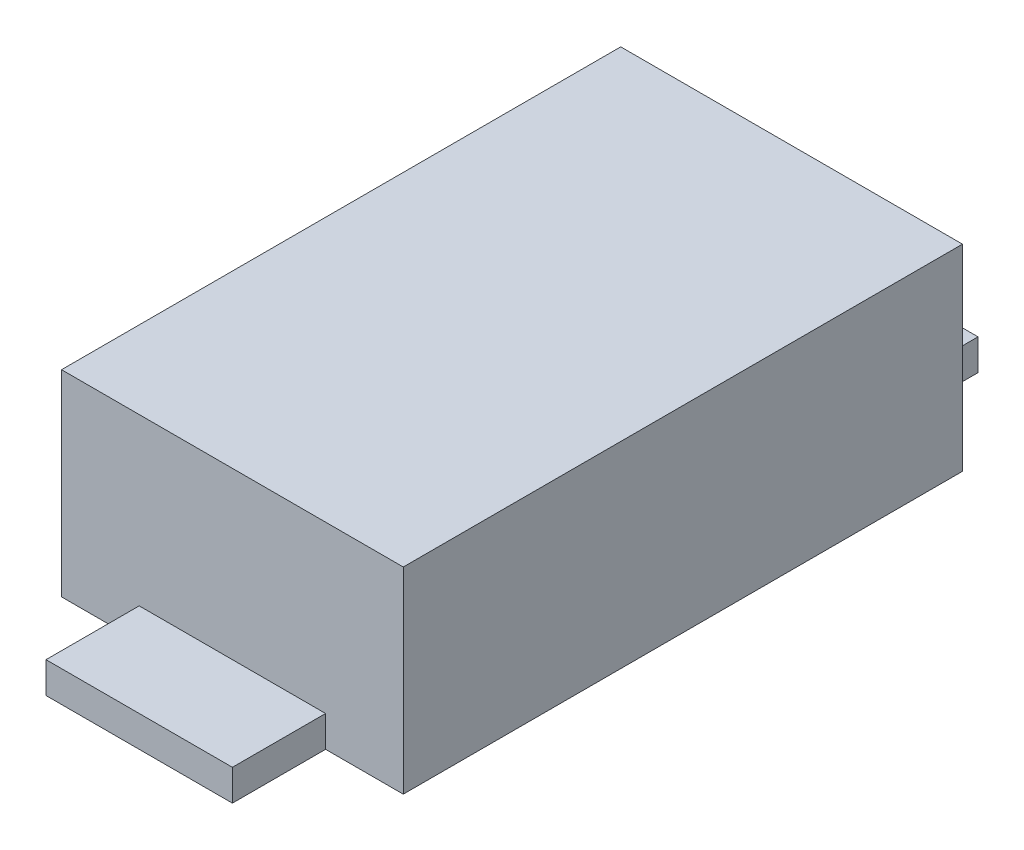
ISO-10303-21;
HEADER;
FILE_DESCRIPTION(('STEP AP214'),'2;1');
FILE_NAME('part.step','',(''),(''),'','','');
FILE_SCHEMA(('AUTOMOTIVE_DESIGN { 1 0 10303 214 1 1 1 1 }'));
ENDSEC;
DATA;
#1=APPLICATION_CONTEXT('core data for automotive mechanical design processes');
#2=APPLICATION_PROTOCOL_DEFINITION('international standard','automotive_design',2000,#1);
#3=PRODUCT_CONTEXT('',#1,'mechanical');
#4=PRODUCT('Part','Part','',(#3));
#5=PRODUCT_RELATED_PRODUCT_CATEGORY('part','',(#4));
#6=PRODUCT_DEFINITION_FORMATION('','',#4);
#7=PRODUCT_DEFINITION_CONTEXT('part definition',#1,'design');
#8=PRODUCT_DEFINITION('design','',#6,#7);
#9=PRODUCT_DEFINITION_SHAPE('','',#8);
#10=(LENGTH_UNIT() NAMED_UNIT(*) SI_UNIT(.MILLI.,.METRE.));
#11=(NAMED_UNIT(*) PLANE_ANGLE_UNIT() SI_UNIT($,.RADIAN.));
#12=(NAMED_UNIT(*) SI_UNIT($,.STERADIAN.) SOLID_ANGLE_UNIT());
#13=UNCERTAINTY_MEASURE_WITH_UNIT(LENGTH_MEASURE(1.E-05),#10,'distance_accuracy_value','');
#14=(GEOMETRIC_REPRESENTATION_CONTEXT(3) GLOBAL_UNCERTAINTY_ASSIGNED_CONTEXT((#13)) GLOBAL_UNIT_ASSIGNED_CONTEXT((#10,
#11,#12)) REPRESENTATION_CONTEXT('',''));
#15=CARTESIAN_POINT('',(0.,0.,0.));
#16=DIRECTION('',(0.,0.,1.));
#17=DIRECTION('',(1.,0.,0.));
#18=AXIS2_PLACEMENT_3D('',#15,#16,#17);
#19=CARTESIAN_POINT('',(-0.825,0.95,1.35));
#20=DIRECTION('',(0.,0.,-1.));
#21=DIRECTION('',(-1.,0.,0.));
#22=AXIS2_PLACEMENT_3D('',#19,#20,#21);
#23=PLANE('',#22);
#24=DIRECTION('',(0.,-1.,0.));
#25=VECTOR('',#24,1.);
#26=CARTESIAN_POINT('',(-0.45,0.15,1.35));
#27=LINE('',#26,#25);
#28=CARTESIAN_POINT('',(-0.45,0.15,1.35));
#29=VERTEX_POINT('',#28);
#30=CARTESIAN_POINT('',(-0.45,0.,1.35));
#31=VERTEX_POINT('',#30);
#32=EDGE_CURVE('E154',#29,#31,#27,.T.);
#33=ORIENTED_EDGE('',*,*,#32,.F.);
#34=DIRECTION('',(1.,0.,0.));
#35=VECTOR('',#34,1.);
#36=CARTESIAN_POINT('',(-0.45,0.15,1.35));
#37=LINE('',#36,#35);
#38=CARTESIAN_POINT('',(0.45,0.15,1.35));
#39=VERTEX_POINT('',#38);
#40=EDGE_CURVE('E145',#29,#39,#37,.T.);
#41=ORIENTED_EDGE('',*,*,#40,.T.);
#42=DIRECTION('',(0.,-1.,0.));
#43=VECTOR('',#42,1.);
#44=CARTESIAN_POINT('',(0.45,0.15,1.35));
#45=LINE('',#44,#43);
#46=CARTESIAN_POINT('',(0.45,0.,1.35));
#47=VERTEX_POINT('',#46);
#48=EDGE_CURVE('E160',#39,#47,#45,.T.);
#49=ORIENTED_EDGE('',*,*,#48,.T.);
#50=DIRECTION('',(1.,0.,0.));
#51=VECTOR('',#50,1.);
#52=CARTESIAN_POINT('',(-0.825,0.,1.35));
#53=LINE('',#52,#51);
#54=CARTESIAN_POINT('',(0.825,0.,1.35));
#55=VERTEX_POINT('',#54);
#56=EDGE_CURVE('E205',#47,#55,#53,.T.);
#57=ORIENTED_EDGE('',*,*,#56,.T.);
#58=DIRECTION('',(0.,-1.,0.));
#59=VECTOR('',#58,1.);
#60=CARTESIAN_POINT('',(0.825,0.95,1.35));
#61=LINE('',#60,#59);
#62=CARTESIAN_POINT('',(0.825,0.95,1.35));
#63=VERTEX_POINT('',#62);
#64=EDGE_CURVE('E196',#63,#55,#61,.T.);
#65=ORIENTED_EDGE('',*,*,#64,.F.);
#66=DIRECTION('',(1.,0.,0.));
#67=VECTOR('',#66,1.);
#68=CARTESIAN_POINT('',(-0.825,0.95,1.35));
#69=LINE('',#68,#67);
#70=CARTESIAN_POINT('',(-0.825,0.95,1.35));
#71=VERTEX_POINT('',#70);
#72=EDGE_CURVE('E194',#71,#63,#69,.T.);
#73=ORIENTED_EDGE('',*,*,#72,.F.);
#74=DIRECTION('',(0.,-1.,0.));
#75=VECTOR('',#74,1.);
#76=CARTESIAN_POINT('',(-0.825,0.95,1.35));
#77=LINE('',#76,#75);
#78=CARTESIAN_POINT('',(-0.825,0.,1.35));
#79=VERTEX_POINT('',#78);
#80=EDGE_CURVE('E210',#71,#79,#77,.T.);
#81=ORIENTED_EDGE('',*,*,#80,.T.);
#82=EDGE_CURVE('E190',#79,#31,#53,.T.);
#83=ORIENTED_EDGE('',*,*,#82,.T.);
#84=EDGE_LOOP('',(#33,#41,#49,#57,#65,#73,#81,#83));
#85=FACE_BOUND('',#84,.T.);
#86=ADVANCED_FACE('F35',(#85),#23,.F.);
#87=CARTESIAN_POINT('',(-0.825000000000001,0.95,-1.35));
#88=DIRECTION('',(0.,0.,1.));
#89=DIRECTION('',(1.,0.,0.));
#90=AXIS2_PLACEMENT_3D('',#87,#88,#89);
#91=PLANE('',#90);
#92=DIRECTION('',(0.,-1.,0.));
#93=VECTOR('',#92,1.);
#94=CARTESIAN_POINT('',(0.45,0.15,-1.35));
#95=LINE('',#94,#93);
#96=CARTESIAN_POINT('',(0.45,0.15,-1.35));
#97=VERTEX_POINT('',#96);
#98=CARTESIAN_POINT('',(0.45,0.,-1.35));
#99=VERTEX_POINT('',#98);
#100=EDGE_CURVE('E181',#97,#99,#95,.T.);
#101=ORIENTED_EDGE('',*,*,#100,.F.);
#102=DIRECTION('',(1.,0.,0.));
#103=VECTOR('',#102,1.);
#104=CARTESIAN_POINT('',(-0.45,0.15,-1.35));
#105=LINE('',#104,#103);
#106=CARTESIAN_POINT('',(-0.45,0.15,-1.35));
#107=VERTEX_POINT('',#106);
#108=EDGE_CURVE('E165',#107,#97,#105,.T.);
#109=ORIENTED_EDGE('',*,*,#108,.F.);
#110=DIRECTION('',(0.,-1.,0.));
#111=VECTOR('',#110,1.);
#112=CARTESIAN_POINT('',(-0.45,0.15,-1.35));
#113=LINE('',#112,#111);
#114=CARTESIAN_POINT('',(-0.45,0.,-1.35));
#115=VERTEX_POINT('',#114);
#116=EDGE_CURVE('E183',#107,#115,#113,.T.);
#117=ORIENTED_EDGE('',*,*,#116,.T.);
#118=DIRECTION('',(-1.,0.,0.));
#119=VECTOR('',#118,1.);
#120=CARTESIAN_POINT('',(-0.825000000000001,0.,-1.35));
#121=LINE('',#120,#119);
#122=CARTESIAN_POINT('',(-0.825000000000001,0.,-1.35));
#123=VERTEX_POINT('',#122);
#124=EDGE_CURVE('E199',#115,#123,#121,.T.);
#125=ORIENTED_EDGE('',*,*,#124,.T.);
#126=DIRECTION('',(0.,-1.,0.));
#127=VECTOR('',#126,1.);
#128=CARTESIAN_POINT('',(-0.825000000000001,0.95,-1.35));
#129=LINE('',#128,#127);
#130=CARTESIAN_POINT('',(-0.825000000000001,0.95,-1.35));
#131=VERTEX_POINT('',#130);
#132=EDGE_CURVE('E43',#131,#123,#129,.T.);
#133=ORIENTED_EDGE('',*,*,#132,.F.);
#134=DIRECTION('',(-1.,0.,0.));
#135=VECTOR('',#134,1.);
#136=CARTESIAN_POINT('',(-0.825000000000001,0.95,-1.35));
#137=LINE('',#136,#135);
#138=CARTESIAN_POINT('',(0.824999999999999,0.95,-1.35));
#139=VERTEX_POINT('',#138);
#140=EDGE_CURVE('E189',#139,#131,#137,.T.);
#141=ORIENTED_EDGE('',*,*,#140,.F.);
#142=DIRECTION('',(0.,-1.,0.));
#143=VECTOR('',#142,1.);
#144=CARTESIAN_POINT('',(0.824999999999999,0.95,-1.35));
#145=LINE('',#144,#143);
#146=CARTESIAN_POINT('',(0.824999999999999,0.,-1.35));
#147=VERTEX_POINT('',#146);
#148=EDGE_CURVE('E11',#139,#147,#145,.T.);
#149=ORIENTED_EDGE('',*,*,#148,.T.);
#150=EDGE_CURVE('E200',#147,#99,#121,.T.);
#151=ORIENTED_EDGE('',*,*,#150,.T.);
#152=EDGE_LOOP('',(#101,#109,#117,#125,#133,#141,#149,#151));
#153=FACE_BOUND('',#152,.T.);
#154=ADVANCED_FACE('F233',(#153),#91,.F.);
#155=CARTESIAN_POINT('',(0.824999999999999,0.95,-1.35));
#156=DIRECTION('',(-1.,0.,0.));
#157=DIRECTION('',(0.,0.,1.));
#158=AXIS2_PLACEMENT_3D('',#155,#156,#157);
#159=PLANE('',#158);
#160=DIRECTION('',(0.,0.,-1.));
#161=VECTOR('',#160,1.);
#162=CARTESIAN_POINT('',(0.824999999999999,0.,-1.35));
#163=LINE('',#162,#161);
#164=EDGE_CURVE('E185',#55,#147,#163,.T.);
#165=ORIENTED_EDGE('',*,*,#164,.T.);
#166=ORIENTED_EDGE('',*,*,#148,.F.);
#167=DIRECTION('',(0.,0.,-1.));
#168=VECTOR('',#167,1.);
#169=CARTESIAN_POINT('',(0.824999999999999,0.95,-1.35));
#170=LINE('',#169,#168);
#171=EDGE_CURVE('E186',#63,#139,#170,.T.);
#172=ORIENTED_EDGE('',*,*,#171,.F.);
#173=ORIENTED_EDGE('',*,*,#64,.T.);
#174=EDGE_LOOP('',(#165,#166,#172,#173));
#175=FACE_BOUND('',#174,.T.);
#176=ADVANCED_FACE('F37',(#175),#159,.F.);
#177=CARTESIAN_POINT('',(-0.825000000000001,0.95,-1.35));
#178=DIRECTION('',(1.,0.,0.));
#179=DIRECTION('',(0.,0.,-1.));
#180=AXIS2_PLACEMENT_3D('',#177,#178,#179);
#181=PLANE('',#180);
#182=DIRECTION('',(0.,0.,1.));
#183=VECTOR('',#182,1.);
#184=CARTESIAN_POINT('',(-0.825000000000001,0.,-1.35));
#185=LINE('',#184,#183);
#186=EDGE_CURVE('E203',#123,#79,#185,.T.);
#187=ORIENTED_EDGE('',*,*,#186,.T.);
#188=ORIENTED_EDGE('',*,*,#80,.F.);
#189=DIRECTION('',(0.,0.,1.));
#190=VECTOR('',#189,1.);
#191=CARTESIAN_POINT('',(-0.825000000000001,0.95,-1.35));
#192=LINE('',#191,#190);
#193=EDGE_CURVE('E192',#131,#71,#192,.T.);
#194=ORIENTED_EDGE('',*,*,#193,.F.);
#195=ORIENTED_EDGE('',*,*,#132,.T.);
#196=EDGE_LOOP('',(#187,#188,#194,#195));
#197=FACE_BOUND('',#196,.T.);
#198=ADVANCED_FACE('F217',(#197),#181,.F.);
#199=CARTESIAN_POINT('',(0.,0.95,0.));
#200=DIRECTION('',(0.,1.,0.));
#201=DIRECTION('',(0.,0.,1.));
#202=AXIS2_PLACEMENT_3D('',#199,#200,#201);
#203=PLANE('',#202);
#204=ORIENTED_EDGE('',*,*,#171,.T.);
#205=ORIENTED_EDGE('',*,*,#140,.T.);
#206=ORIENTED_EDGE('',*,*,#193,.T.);
#207=ORIENTED_EDGE('',*,*,#72,.T.);
#208=EDGE_LOOP('',(#204,#205,#206,#207));
#209=FACE_BOUND('',#208,.T.);
#210=ADVANCED_FACE('F230',(#209),#203,.T.);
#211=CARTESIAN_POINT('',(0.,0.,0.));
#212=DIRECTION('',(0.,1.,0.));
#213=DIRECTION('',(0.,0.,1.));
#214=AXIS2_PLACEMENT_3D('',#211,#212,#213);
#215=PLANE('',#214);
#216=ORIENTED_EDGE('',*,*,#164,.F.);
#217=ORIENTED_EDGE('',*,*,#56,.F.);
#218=DIRECTION('',(0.,0.,1.));
#219=VECTOR('',#218,1.);
#220=CARTESIAN_POINT('',(0.45,0.,1.35));
#221=LINE('',#220,#219);
#222=CARTESIAN_POINT('',(0.45,0.,1.8));
#223=VERTEX_POINT('',#222);
#224=EDGE_CURVE('E50',#47,#223,#221,.T.);
#225=ORIENTED_EDGE('',*,*,#224,.T.);
#226=DIRECTION('',(-1.,0.,0.));
#227=VECTOR('',#226,1.);
#228=CARTESIAN_POINT('',(-0.45,0.,1.8));
#229=LINE('',#228,#227);
#230=CARTESIAN_POINT('',(-0.45,0.,1.8));
#231=VERTEX_POINT('',#230);
#232=EDGE_CURVE('E156',#223,#231,#229,.T.);
#233=ORIENTED_EDGE('',*,*,#232,.T.);
#234=DIRECTION('',(0.,0.,-1.));
#235=VECTOR('',#234,1.);
#236=CARTESIAN_POINT('',(-0.45,0.,1.35));
#237=LINE('',#236,#235);
#238=EDGE_CURVE('E131',#231,#31,#237,.T.);
#239=ORIENTED_EDGE('',*,*,#238,.T.);
#240=ORIENTED_EDGE('',*,*,#82,.F.);
#241=ORIENTED_EDGE('',*,*,#186,.F.);
#242=ORIENTED_EDGE('',*,*,#124,.F.);
#243=DIRECTION('',(0.,0.,1.));
#244=VECTOR('',#243,1.);
#245=CARTESIAN_POINT('',(-0.45,0.,-1.35));
#246=LINE('',#245,#244);
#247=CARTESIAN_POINT('',(-0.45,0.,-1.8));
#248=VERTEX_POINT('',#247);
#249=EDGE_CURVE('E58',#248,#115,#246,.T.);
#250=ORIENTED_EDGE('',*,*,#249,.F.);
#251=DIRECTION('',(-1.,0.,0.));
#252=VECTOR('',#251,1.);
#253=CARTESIAN_POINT('',(-0.45,0.,-1.8));
#254=LINE('',#253,#252);
#255=CARTESIAN_POINT('',(0.45,0.,-1.8));
#256=VERTEX_POINT('',#255);
#257=EDGE_CURVE('E166',#256,#248,#254,.T.);
#258=ORIENTED_EDGE('',*,*,#257,.F.);
#259=DIRECTION('',(0.,0.,-1.));
#260=VECTOR('',#259,1.);
#261=CARTESIAN_POINT('',(0.45,0.,-1.35));
#262=LINE('',#261,#260);
#263=EDGE_CURVE('E174',#99,#256,#262,.T.);
#264=ORIENTED_EDGE('',*,*,#263,.F.);
#265=ORIENTED_EDGE('',*,*,#150,.F.);
#266=EDGE_LOOP('',(#216,#217,#225,#233,#239,#240,#241,#242,#250,#258,#264,#265));
#267=FACE_BOUND('',#266,.T.);
#268=ADVANCED_FACE('F224',(#267),#215,.F.);
#269=CARTESIAN_POINT('',(-0.45,0.15,-1.35));
#270=DIRECTION('',(1.,0.,0.));
#271=DIRECTION('',(0.,0.,-1.));
#272=AXIS2_PLACEMENT_3D('',#269,#270,#271);
#273=PLANE('',#272);
#274=ORIENTED_EDGE('',*,*,#249,.T.);
#275=ORIENTED_EDGE('',*,*,#116,.F.);
#276=DIRECTION('',(0.,0.,1.));
#277=VECTOR('',#276,1.);
#278=CARTESIAN_POINT('',(-0.45,0.15,-1.35));
#279=LINE('',#278,#277);
#280=CARTESIAN_POINT('',(-0.45,0.15,-1.8));
#281=VERTEX_POINT('',#280);
#282=EDGE_CURVE('E163',#281,#107,#279,.T.);
#283=ORIENTED_EDGE('',*,*,#282,.F.);
#284=DIRECTION('',(0.,-1.,0.));
#285=VECTOR('',#284,1.);
#286=CARTESIAN_POINT('',(-0.45,0.15,-1.8));
#287=LINE('',#286,#285);
#288=EDGE_CURVE('E172',#281,#248,#287,.T.);
#289=ORIENTED_EDGE('',*,*,#288,.T.);
#290=EDGE_LOOP('',(#274,#275,#283,#289));
#291=FACE_BOUND('',#290,.T.);
#292=ADVANCED_FACE('F250',(#291),#273,.F.);
#293=CARTESIAN_POINT('',(0.45,0.15,-1.35));
#294=DIRECTION('',(-1.,0.,0.));
#295=DIRECTION('',(0.,0.,1.));
#296=AXIS2_PLACEMENT_3D('',#293,#294,#295);
#297=PLANE('',#296);
#298=ORIENTED_EDGE('',*,*,#263,.T.);
#299=DIRECTION('',(0.,-1.,0.));
#300=VECTOR('',#299,1.);
#301=CARTESIAN_POINT('',(0.45,0.15,-1.8));
#302=LINE('',#301,#300);
#303=CARTESIAN_POINT('',(0.45,0.15,-1.8));
#304=VERTEX_POINT('',#303);
#305=EDGE_CURVE('E178',#304,#256,#302,.T.);
#306=ORIENTED_EDGE('',*,*,#305,.F.);
#307=DIRECTION('',(0.,0.,-1.));
#308=VECTOR('',#307,1.);
#309=CARTESIAN_POINT('',(0.45,0.15,-1.35));
#310=LINE('',#309,#308);
#311=EDGE_CURVE('E168',#97,#304,#310,.T.);
#312=ORIENTED_EDGE('',*,*,#311,.F.);
#313=ORIENTED_EDGE('',*,*,#100,.T.);
#314=EDGE_LOOP('',(#298,#306,#312,#313));
#315=FACE_BOUND('',#314,.T.);
#316=ADVANCED_FACE('F240',(#315),#297,.F.);
#317=CARTESIAN_POINT('',(-0.45,0.15,-1.8));
#318=DIRECTION('',(0.,0.,1.));
#319=DIRECTION('',(1.,0.,0.));
#320=AXIS2_PLACEMENT_3D('',#317,#318,#319);
#321=PLANE('',#320);
#322=ORIENTED_EDGE('',*,*,#257,.T.);
#323=ORIENTED_EDGE('',*,*,#288,.F.);
#324=DIRECTION('',(-1.,0.,0.));
#325=VECTOR('',#324,1.);
#326=CARTESIAN_POINT('',(-0.45,0.15,-1.8));
#327=LINE('',#326,#325);
#328=EDGE_CURVE('E170',#304,#281,#327,.T.);
#329=ORIENTED_EDGE('',*,*,#328,.F.);
#330=ORIENTED_EDGE('',*,*,#305,.T.);
#331=EDGE_LOOP('',(#322,#323,#329,#330));
#332=FACE_BOUND('',#331,.T.);
#333=ADVANCED_FACE('F244',(#332),#321,.F.);
#334=CARTESIAN_POINT('',(0.,0.15,0.));
#335=DIRECTION('',(0.,-1.,0.));
#336=DIRECTION('',(0.,0.,-1.));
#337=AXIS2_PLACEMENT_3D('',#334,#335,#336);
#338=PLANE('',#337);
#339=ORIENTED_EDGE('',*,*,#282,.T.);
#340=ORIENTED_EDGE('',*,*,#108,.T.);
#341=ORIENTED_EDGE('',*,*,#311,.T.);
#342=ORIENTED_EDGE('',*,*,#328,.T.);
#343=EDGE_LOOP('',(#339,#340,#341,#342));
#344=FACE_BOUND('',#343,.T.);
#345=ADVANCED_FACE('F248',(#344),#338,.F.);
#346=CARTESIAN_POINT('',(-0.45,0.15,1.35));
#347=DIRECTION('',(-1.,0.,0.));
#348=DIRECTION('',(0.,0.,1.));
#349=AXIS2_PLACEMENT_3D('',#346,#347,#348);
#350=PLANE('',#349);
#351=ORIENTED_EDGE('',*,*,#238,.F.);
#352=DIRECTION('',(0.,-1.,0.));
#353=VECTOR('',#352,1.);
#354=CARTESIAN_POINT('',(-0.45,0.15,1.8));
#355=LINE('',#354,#353);
#356=CARTESIAN_POINT('',(-0.45,0.15,1.8));
#357=VERTEX_POINT('',#356);
#358=EDGE_CURVE('E125',#357,#231,#355,.T.);
#359=ORIENTED_EDGE('',*,*,#358,.F.);
#360=DIRECTION('',(0.,0.,-1.));
#361=VECTOR('',#360,1.);
#362=CARTESIAN_POINT('',(-0.45,0.15,1.35));
#363=LINE('',#362,#361);
#364=EDGE_CURVE('E128',#357,#29,#363,.T.);
#365=ORIENTED_EDGE('',*,*,#364,.T.);
#366=ORIENTED_EDGE('',*,*,#32,.T.);
#367=EDGE_LOOP('',(#351,#359,#365,#366));
#368=FACE_BOUND('',#367,.T.);
#369=ADVANCED_FACE('F127',(#368),#350,.T.);
#370=CARTESIAN_POINT('',(-0.45,0.15,1.8));
#371=DIRECTION('',(0.,0.,1.));
#372=DIRECTION('',(1.,0.,0.));
#373=AXIS2_PLACEMENT_3D('',#370,#371,#372);
#374=PLANE('',#373);
#375=ORIENTED_EDGE('',*,*,#232,.F.);
#376=DIRECTION('',(0.,-1.,0.));
#377=VECTOR('',#376,1.);
#378=CARTESIAN_POINT('',(0.45,0.15,1.8));
#379=LINE('',#378,#377);
#380=CARTESIAN_POINT('',(0.45,0.15,1.8));
#381=VERTEX_POINT('',#380);
#382=EDGE_CURVE('E136',#381,#223,#379,.T.);
#383=ORIENTED_EDGE('',*,*,#382,.F.);
#384=DIRECTION('',(-1.,0.,0.));
#385=VECTOR('',#384,1.);
#386=CARTESIAN_POINT('',(-0.45,0.15,1.8));
#387=LINE('',#386,#385);
#388=EDGE_CURVE('E142',#381,#357,#387,.T.);
#389=ORIENTED_EDGE('',*,*,#388,.T.);
#390=ORIENTED_EDGE('',*,*,#358,.T.);
#391=EDGE_LOOP('',(#375,#383,#389,#390));
#392=FACE_BOUND('',#391,.T.);
#393=ADVANCED_FACE('F148',(#392),#374,.T.);
#394=CARTESIAN_POINT('',(0.45,0.15,1.35));
#395=DIRECTION('',(1.,0.,0.));
#396=DIRECTION('',(0.,0.,-1.));
#397=AXIS2_PLACEMENT_3D('',#394,#395,#396);
#398=PLANE('',#397);
#399=ORIENTED_EDGE('',*,*,#224,.F.);
#400=ORIENTED_EDGE('',*,*,#48,.F.);
#401=DIRECTION('',(0.,0.,1.));
#402=VECTOR('',#401,1.);
#403=CARTESIAN_POINT('',(0.45,0.15,1.35));
#404=LINE('',#403,#402);
#405=EDGE_CURVE('E149',#39,#381,#404,.T.);
#406=ORIENTED_EDGE('',*,*,#405,.T.);
#407=ORIENTED_EDGE('',*,*,#382,.T.);
#408=EDGE_LOOP('',(#399,#400,#406,#407));
#409=FACE_BOUND('',#408,.T.);
#410=ADVANCED_FACE('F334',(#409),#398,.T.);
#411=CARTESIAN_POINT('',(0.,0.15,0.));
#412=DIRECTION('',(0.,-1.,0.));
#413=DIRECTION('',(0.,0.,1.));
#414=AXIS2_PLACEMENT_3D('',#411,#412,#413);
#415=PLANE('',#414);
#416=ORIENTED_EDGE('',*,*,#364,.F.);
#417=ORIENTED_EDGE('',*,*,#388,.F.);
#418=ORIENTED_EDGE('',*,*,#405,.F.);
#419=ORIENTED_EDGE('',*,*,#40,.F.);
#420=EDGE_LOOP('',(#416,#417,#418,#419));
#421=FACE_BOUND('',#420,.T.);
#422=ADVANCED_FACE('F140',(#421),#415,.F.);
#423=CLOSED_SHELL('',(#86,#154,#176,#198,#210,#268,#292,#316,#333,#345,#369,#393,#410,#422));
#424=MANIFOLD_SOLID_BREP('B2',#423);
#425=ADVANCED_BREP_SHAPE_REPRESENTATION('',(#18,#424),#14);
#426=SHAPE_DEFINITION_REPRESENTATION(#9,#425);
ENDSEC;
END-ISO-10303-21;
